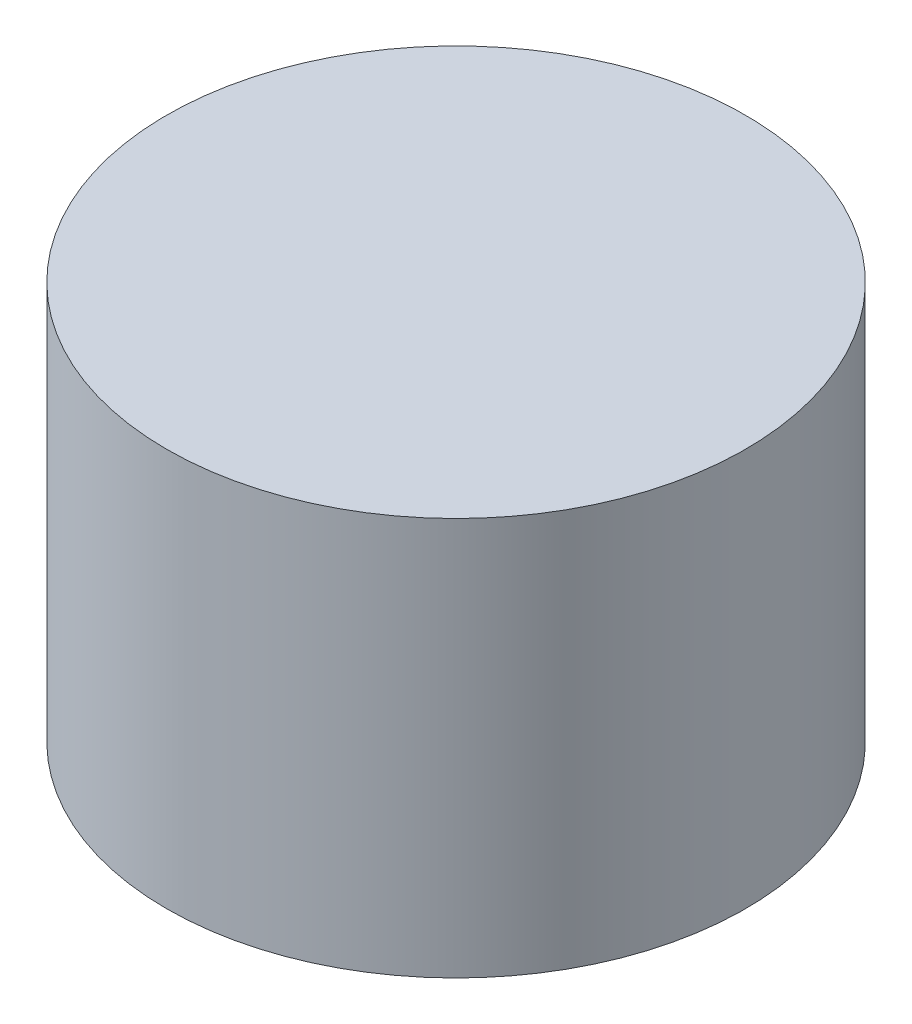
ISO-10303-21;
HEADER;
FILE_DESCRIPTION(('STEP AP214'),'2;1');
FILE_NAME('part.step','',(''),(''),'','','');
FILE_SCHEMA(('AUTOMOTIVE_DESIGN { 1 0 10303 214 1 1 1 1 }'));
ENDSEC;
DATA;
#1=APPLICATION_CONTEXT('core data for automotive mechanical design processes');
#2=APPLICATION_PROTOCOL_DEFINITION('international standard','automotive_design',2000,#1);
#3=PRODUCT_CONTEXT('',#1,'mechanical');
#4=PRODUCT('Part','Part','',(#3));
#5=PRODUCT_RELATED_PRODUCT_CATEGORY('part','',(#4));
#6=PRODUCT_DEFINITION_FORMATION('','',#4);
#7=PRODUCT_DEFINITION_CONTEXT('part definition',#1,'design');
#8=PRODUCT_DEFINITION('design','',#6,#7);
#9=PRODUCT_DEFINITION_SHAPE('','',#8);
#10=(LENGTH_UNIT() NAMED_UNIT(*) SI_UNIT(.MILLI.,.METRE.));
#11=(NAMED_UNIT(*) PLANE_ANGLE_UNIT() SI_UNIT($,.RADIAN.));
#12=(NAMED_UNIT(*) SI_UNIT($,.STERADIAN.) SOLID_ANGLE_UNIT());
#13=UNCERTAINTY_MEASURE_WITH_UNIT(LENGTH_MEASURE(1.E-05),#10,'distance_accuracy_value','');
#14=(GEOMETRIC_REPRESENTATION_CONTEXT(3) GLOBAL_UNCERTAINTY_ASSIGNED_CONTEXT((#13)) GLOBAL_UNIT_ASSIGNED_CONTEXT((#10,
#11,#12)) REPRESENTATION_CONTEXT('',''));
#15=CARTESIAN_POINT('',(0.,0.,0.));
#16=DIRECTION('',(0.,0.,1.));
#17=DIRECTION('',(1.,0.,0.));
#18=AXIS2_PLACEMENT_3D('',#15,#16,#17);
#19=CARTESIAN_POINT('',(0.,-5.5,0.));
#20=DIRECTION('',(0.,1.,0.));
#21=DIRECTION('',(0.,0.,1.));
#22=AXIS2_PLACEMENT_3D('',#19,#20,#21);
#23=CYLINDRICAL_SURFACE('',#22,4.);
#24=CARTESIAN_POINT('',(0.,-5.5,0.));
#25=DIRECTION('',(0.,1.,0.));
#26=DIRECTION('',(0.,0.,1.));
#27=AXIS2_PLACEMENT_3D('',#24,#25,#26);
#28=CIRCLE('',#27,4.);
#29=CARTESIAN_POINT('',(0.,-5.5,4.));
#30=VERTEX_POINT('',#29);
#31=EDGE_CURVE('E10',#30,#30,#28,.T.);
#32=ORIENTED_EDGE('',*,*,#31,.T.);
#33=EDGE_LOOP('',(#32));
#34=FACE_BOUND('',#33,.T.);
#35=CARTESIAN_POINT('',(0.,0.,0.));
#36=DIRECTION('',(0.,1.,0.));
#37=DIRECTION('',(0.,0.,1.));
#38=AXIS2_PLACEMENT_3D('',#35,#36,#37);
#39=CIRCLE('',#38,4.);
#40=CARTESIAN_POINT('',(0.,0.,4.));
#41=VERTEX_POINT('',#40);
#42=EDGE_CURVE('E42',#41,#41,#39,.T.);
#43=ORIENTED_EDGE('',*,*,#42,.F.);
#44=EDGE_LOOP('',(#43));
#45=FACE_BOUND('',#44,.T.);
#46=ADVANCED_FACE('F39',(#34,#45),#23,.T.);
#47=CARTESIAN_POINT('',(0.,-5.5,0.));
#48=DIRECTION('',(0.,1.,0.));
#49=DIRECTION('',(0.,0.,1.));
#50=AXIS2_PLACEMENT_3D('',#47,#48,#49);
#51=PLANE('',#50);
#52=ORIENTED_EDGE('',*,*,#31,.F.);
#53=EDGE_LOOP('',(#52));
#54=FACE_BOUND('',#53,.T.);
#55=ADVANCED_FACE('F54',(#54),#51,.F.);
#56=CARTESIAN_POINT('',(0.,0.,0.));
#57=DIRECTION('',(0.,1.,0.));
#58=DIRECTION('',(0.,0.,1.));
#59=AXIS2_PLACEMENT_3D('',#56,#57,#58);
#60=PLANE('',#59);
#61=ORIENTED_EDGE('',*,*,#42,.T.);
#62=EDGE_LOOP('',(#61));
#63=FACE_BOUND('',#62,.T.);
#64=ADVANCED_FACE('F51',(#63),#60,.T.);
#65=CLOSED_SHELL('',(#46,#55,#64));
#66=MANIFOLD_SOLID_BREP('B2',#65);
#67=ADVANCED_BREP_SHAPE_REPRESENTATION('',(#18,#66),#14);
#68=SHAPE_DEFINITION_REPRESENTATION(#9,#67);
ENDSEC;
END-ISO-10303-21;
